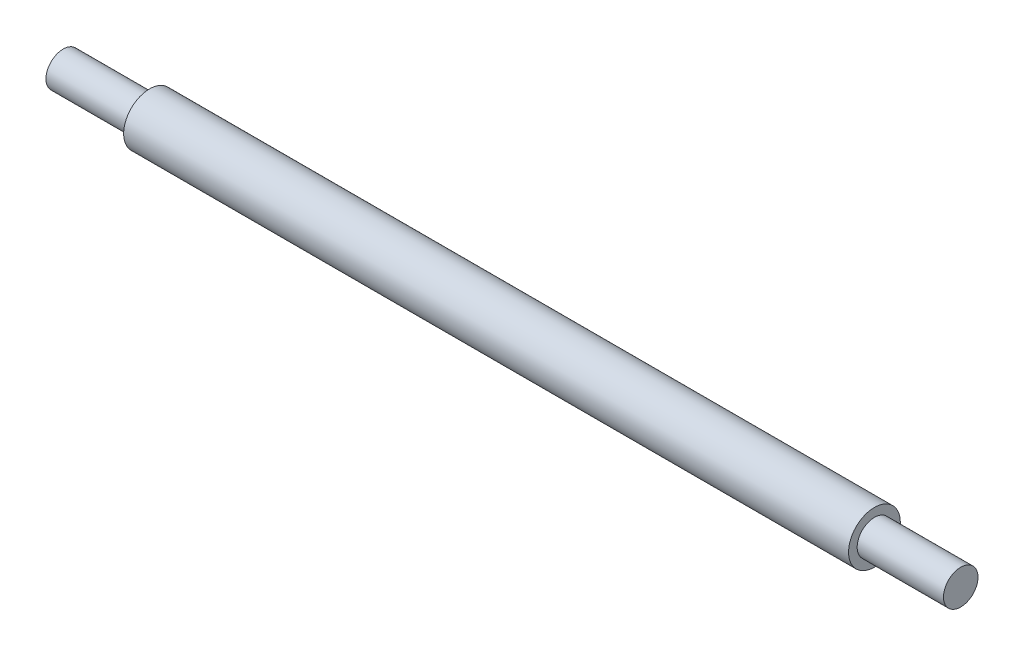
ISO-10303-21;
HEADER;
FILE_DESCRIPTION(('STEP AP214'),'2;1');
FILE_NAME('part.step','',(''),(''),'','','');
FILE_SCHEMA(('AUTOMOTIVE_DESIGN { 1 0 10303 214 1 1 1 1 }'));
ENDSEC;
DATA;
#1=APPLICATION_CONTEXT('core data for automotive mechanical design processes');
#2=APPLICATION_PROTOCOL_DEFINITION('international standard','automotive_design',2000,#1);
#3=PRODUCT_CONTEXT('',#1,'mechanical');
#4=PRODUCT('Part','Part','',(#3));
#5=PRODUCT_RELATED_PRODUCT_CATEGORY('part','',(#4));
#6=PRODUCT_DEFINITION_FORMATION('','',#4);
#7=PRODUCT_DEFINITION_CONTEXT('part definition',#1,'design');
#8=PRODUCT_DEFINITION('design','',#6,#7);
#9=PRODUCT_DEFINITION_SHAPE('','',#8);
#10=(LENGTH_UNIT() NAMED_UNIT(*) SI_UNIT(.MILLI.,.METRE.));
#11=(NAMED_UNIT(*) PLANE_ANGLE_UNIT() SI_UNIT($,.RADIAN.));
#12=(NAMED_UNIT(*) SI_UNIT($,.STERADIAN.) SOLID_ANGLE_UNIT());
#13=UNCERTAINTY_MEASURE_WITH_UNIT(LENGTH_MEASURE(1.E-05),#10,'distance_accuracy_value','');
#14=(GEOMETRIC_REPRESENTATION_CONTEXT(3) GLOBAL_UNCERTAINTY_ASSIGNED_CONTEXT((#13)) GLOBAL_UNIT_ASSIGNED_CONTEXT((#10,
#11,#12)) REPRESENTATION_CONTEXT('',''));
#15=CARTESIAN_POINT('',(0.,0.,0.));
#16=DIRECTION('',(0.,0.,1.));
#17=DIRECTION('',(1.,0.,0.));
#18=AXIS2_PLACEMENT_3D('',#15,#16,#17);
#19=CARTESIAN_POINT('',(10.,0.,0.));
#20=DIRECTION('',(-1.,0.,0.));
#21=DIRECTION('',(0.,0.,1.));
#22=AXIS2_PLACEMENT_3D('',#19,#20,#21);
#23=CYLINDRICAL_SURFACE('',#22,2.);
#24=CARTESIAN_POINT('',(10.,0.,0.));
#25=DIRECTION('',(1.,0.,0.));
#26=DIRECTION('',(0.,0.,-1.));
#27=AXIS2_PLACEMENT_3D('',#24,#25,#26);
#28=CIRCLE('',#27,2.);
#29=CARTESIAN_POINT('',(10.,0.,-2.));
#30=VERTEX_POINT('',#29);
#31=EDGE_CURVE('E42',#30,#30,#28,.T.);
#32=ORIENTED_EDGE('',*,*,#31,.F.);
#33=EDGE_LOOP('',(#32));
#34=FACE_BOUND('',#33,.T.);
#35=CARTESIAN_POINT('',(0.,0.,0.));
#36=DIRECTION('',(1.,0.,0.));
#37=DIRECTION('',(0.,0.,-1.));
#38=AXIS2_PLACEMENT_3D('',#35,#36,#37);
#39=CIRCLE('',#38,2.);
#40=CARTESIAN_POINT('',(0.,0.,-2.));
#41=VERTEX_POINT('',#40);
#42=EDGE_CURVE('E38',#41,#41,#39,.T.);
#43=ORIENTED_EDGE('',*,*,#42,.T.);
#44=EDGE_LOOP('',(#43));
#45=FACE_BOUND('',#44,.T.);
#46=ADVANCED_FACE('F35',(#34,#45),#23,.T.);
#47=CARTESIAN_POINT('',(0.,0.,0.));
#48=DIRECTION('',(1.,0.,0.));
#49=DIRECTION('',(0.,0.,-1.));
#50=AXIS2_PLACEMENT_3D('',#47,#48,#49);
#51=PLANE('',#50);
#52=ORIENTED_EDGE('',*,*,#42,.F.);
#53=EDGE_LOOP('',(#52));
#54=FACE_BOUND('',#53,.T.);
#55=ADVANCED_FACE('F76',(#54),#51,.F.);
#56=CARTESIAN_POINT('',(94.,0.,0.));
#57=DIRECTION('',(-1.,0.,0.));
#58=DIRECTION('',(0.,0.,1.));
#59=AXIS2_PLACEMENT_3D('',#56,#57,#58);
#60=CYLINDRICAL_SURFACE('',#59,3.);
#61=CARTESIAN_POINT('',(94.,0.,0.));
#62=DIRECTION('',(1.,0.,0.));
#63=DIRECTION('',(0.,0.,-1.));
#64=AXIS2_PLACEMENT_3D('',#61,#62,#63);
#65=CIRCLE('',#64,3.);
#66=CARTESIAN_POINT('',(94.,0.,-3.));
#67=VERTEX_POINT('',#66);
#68=EDGE_CURVE('E50',#67,#67,#65,.T.);
#69=ORIENTED_EDGE('',*,*,#68,.F.);
#70=EDGE_LOOP('',(#69));
#71=FACE_BOUND('',#70,.T.);
#72=CARTESIAN_POINT('',(10.,0.,0.));
#73=DIRECTION('',(1.,0.,0.));
#74=DIRECTION('',(0.,0.,-1.));
#75=AXIS2_PLACEMENT_3D('',#72,#73,#74);
#76=CIRCLE('',#75,3.);
#77=CARTESIAN_POINT('',(10.,0.,-3.));
#78=VERTEX_POINT('',#77);
#79=EDGE_CURVE('E53',#78,#78,#76,.T.);
#80=ORIENTED_EDGE('',*,*,#79,.T.);
#81=EDGE_LOOP('',(#80));
#82=FACE_BOUND('',#81,.T.);
#83=ADVANCED_FACE('F81',(#71,#82),#60,.T.);
#84=CARTESIAN_POINT('',(94.,0.,0.));
#85=DIRECTION('',(1.,0.,0.));
#86=DIRECTION('',(0.,0.,-1.));
#87=AXIS2_PLACEMENT_3D('',#84,#85,#86);
#88=PLANE('',#87);
#89=CARTESIAN_POINT('',(94.,0.,0.));
#90=DIRECTION('',(1.,0.,0.));
#91=DIRECTION('',(0.,0.,-1.));
#92=AXIS2_PLACEMENT_3D('',#89,#90,#91);
#93=CIRCLE('',#92,2.);
#94=CARTESIAN_POINT('',(94.,0.,-2.));
#95=VERTEX_POINT('',#94);
#96=EDGE_CURVE('E10',#95,#95,#93,.T.);
#97=ORIENTED_EDGE('',*,*,#96,.F.);
#98=EDGE_LOOP('',(#97));
#99=FACE_BOUND('',#98,.T.);
#100=ORIENTED_EDGE('',*,*,#68,.T.);
#101=EDGE_LOOP('',(#100));
#102=FACE_BOUND('',#101,.T.);
#103=ADVANCED_FACE('F71',(#99,#102),#88,.T.);
#104=CARTESIAN_POINT('',(10.,0.,0.));
#105=DIRECTION('',(1.,0.,0.));
#106=DIRECTION('',(0.,0.,-1.));
#107=AXIS2_PLACEMENT_3D('',#104,#105,#106);
#108=PLANE('',#107);
#109=ORIENTED_EDGE('',*,*,#31,.T.);
#110=EDGE_LOOP('',(#109));
#111=FACE_BOUND('',#110,.T.);
#112=ORIENTED_EDGE('',*,*,#79,.F.);
#113=EDGE_LOOP('',(#112));
#114=FACE_BOUND('',#113,.T.);
#115=ADVANCED_FACE('F64',(#111,#114),#108,.F.);
#116=CARTESIAN_POINT('',(104.,0.,0.));
#117=DIRECTION('',(-1.,0.,0.));
#118=DIRECTION('',(0.,0.,1.));
#119=AXIS2_PLACEMENT_3D('',#116,#117,#118);
#120=CYLINDRICAL_SURFACE('',#119,2.);
#121=CARTESIAN_POINT('',(104.,0.,0.));
#122=DIRECTION('',(1.,0.,0.));
#123=DIRECTION('',(0.,0.,-1.));
#124=AXIS2_PLACEMENT_3D('',#121,#122,#123);
#125=CIRCLE('',#124,2.);
#126=CARTESIAN_POINT('',(104.,0.,-2.));
#127=VERTEX_POINT('',#126);
#128=EDGE_CURVE('E49',#127,#127,#125,.T.);
#129=ORIENTED_EDGE('',*,*,#128,.F.);
#130=EDGE_LOOP('',(#129));
#131=FACE_BOUND('',#130,.T.);
#132=ORIENTED_EDGE('',*,*,#96,.T.);
#133=EDGE_LOOP('',(#132));
#134=FACE_BOUND('',#133,.T.);
#135=ADVANCED_FACE('F62',(#131,#134),#120,.T.);
#136=CARTESIAN_POINT('',(104.,0.,0.));
#137=DIRECTION('',(1.,0.,0.));
#138=DIRECTION('',(0.,0.,-1.));
#139=AXIS2_PLACEMENT_3D('',#136,#137,#138);
#140=PLANE('',#139);
#141=ORIENTED_EDGE('',*,*,#128,.T.);
#142=EDGE_LOOP('',(#141));
#143=FACE_BOUND('',#142,.T.);
#144=ADVANCED_FACE('F60',(#143),#140,.T.);
#145=CLOSED_SHELL('',(#46,#55,#83,#103,#115,#135,#144));
#146=MANIFOLD_SOLID_BREP('B2',#145);
#147=ADVANCED_BREP_SHAPE_REPRESENTATION('',(#18,#146),#14);
#148=SHAPE_DEFINITION_REPRESENTATION(#9,#147);
ENDSEC;
END-ISO-10303-21;
